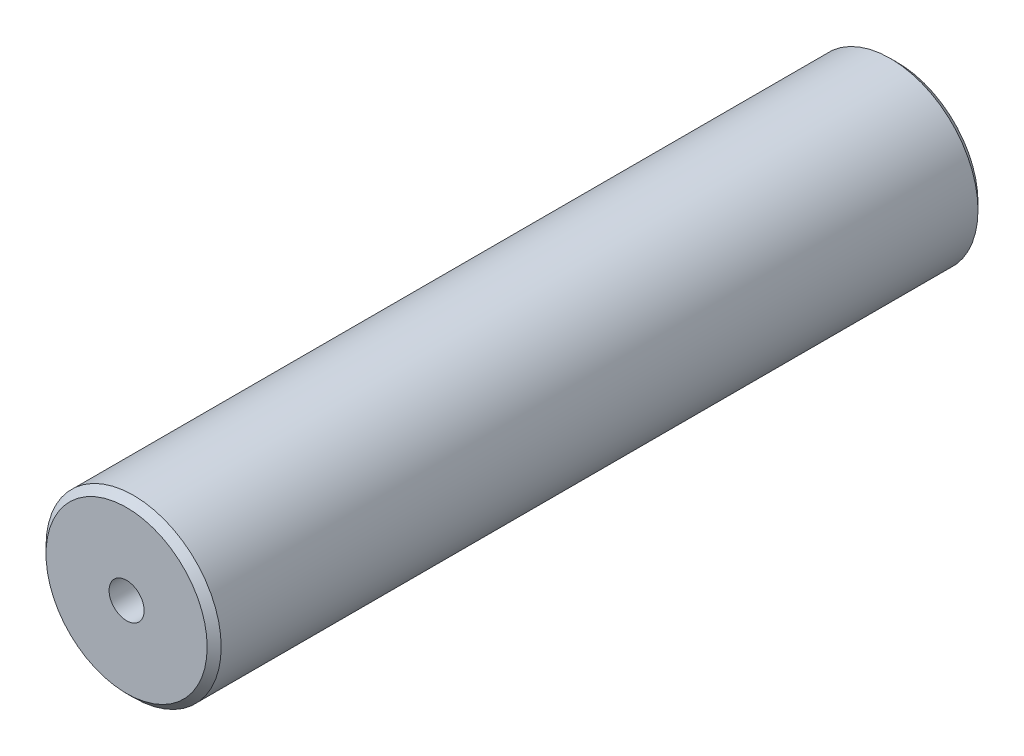
ISO-10303-21;
HEADER;
FILE_DESCRIPTION(('STEP AP214'),'2;1');
FILE_NAME('part.step','',(''),(''),'','','');
FILE_SCHEMA(('AUTOMOTIVE_DESIGN { 1 0 10303 214 1 1 1 1 }'));
ENDSEC;
DATA;
#1=APPLICATION_CONTEXT('core data for automotive mechanical design processes');
#2=APPLICATION_PROTOCOL_DEFINITION('international standard','automotive_design',2000,#1);
#3=PRODUCT_CONTEXT('',#1,'mechanical');
#4=PRODUCT('Part','Part','',(#3));
#5=PRODUCT_RELATED_PRODUCT_CATEGORY('part','',(#4));
#6=PRODUCT_DEFINITION_FORMATION('','',#4);
#7=PRODUCT_DEFINITION_CONTEXT('part definition',#1,'design');
#8=PRODUCT_DEFINITION('design','',#6,#7);
#9=PRODUCT_DEFINITION_SHAPE('','',#8);
#10=(LENGTH_UNIT() NAMED_UNIT(*) SI_UNIT(.MILLI.,.METRE.));
#11=(NAMED_UNIT(*) PLANE_ANGLE_UNIT() SI_UNIT($,.RADIAN.));
#12=(NAMED_UNIT(*) SI_UNIT($,.STERADIAN.) SOLID_ANGLE_UNIT());
#13=UNCERTAINTY_MEASURE_WITH_UNIT(LENGTH_MEASURE(1.E-05),#10,'distance_accuracy_value','');
#14=(GEOMETRIC_REPRESENTATION_CONTEXT(3) GLOBAL_UNCERTAINTY_ASSIGNED_CONTEXT((#13)) GLOBAL_UNIT_ASSIGNED_CONTEXT((#10,
#11,#12)) REPRESENTATION_CONTEXT('',''));
#15=CARTESIAN_POINT('',(0.,0.,0.));
#16=DIRECTION('',(0.,0.,1.));
#17=DIRECTION('',(1.,0.,0.));
#18=AXIS2_PLACEMENT_3D('',#15,#16,#17);
#19=CARTESIAN_POINT('',(0.,0.,55.));
#20=DIRECTION('',(0.,0.,-1.));
#21=DIRECTION('',(-1.,0.,0.));
#22=AXIS2_PLACEMENT_3D('',#19,#20,#21);
#23=CYLINDRICAL_SURFACE('',#22,12.5);
#24=CARTESIAN_POINT('',(0.,0.,-54.));
#25=DIRECTION('',(0.,0.,1.));
#26=DIRECTION('',(1.,0.,0.));
#27=AXIS2_PLACEMENT_3D('',#24,#25,#26);
#28=CIRCLE('',#27,12.5);
#29=CARTESIAN_POINT('',(12.5,0.,-54.));
#30=VERTEX_POINT('',#29);
#31=EDGE_CURVE('E96',#30,#30,#28,.T.);
#32=ORIENTED_EDGE('',*,*,#31,.T.);
#33=EDGE_LOOP('',(#32));
#34=FACE_BOUND('',#33,.T.);
#35=CARTESIAN_POINT('',(0.,0.,54.));
#36=DIRECTION('',(0.,0.,1.));
#37=DIRECTION('',(1.,0.,0.));
#38=AXIS2_PLACEMENT_3D('',#35,#36,#37);
#39=CIRCLE('',#38,12.5);
#40=CARTESIAN_POINT('',(12.5,0.,54.));
#41=VERTEX_POINT('',#40);
#42=EDGE_CURVE('E93',#41,#41,#39,.F.);
#43=ORIENTED_EDGE('',*,*,#42,.T.);
#44=EDGE_LOOP('',(#43));
#45=FACE_BOUND('',#44,.T.);
#46=ADVANCED_FACE('F57',(#34,#45),#23,.T.);
#47=CARTESIAN_POINT('',(0.,0.,55.));
#48=DIRECTION('',(0.,0.,1.));
#49=DIRECTION('',(1.,0.,0.));
#50=AXIS2_PLACEMENT_3D('',#47,#48,#49);
#51=PLANE('',#50);
#52=CARTESIAN_POINT('',(0.,0.,55.));
#53=DIRECTION('',(0.,0.,1.));
#54=DIRECTION('',(1.,0.,0.));
#55=AXIS2_PLACEMENT_3D('',#52,#53,#54);
#56=CIRCLE('',#55,2.49999999999999);
#57=CARTESIAN_POINT('',(2.49999999999999,0.,55.));
#58=VERTEX_POINT('',#57);
#59=EDGE_CURVE('E82',#58,#58,#56,.T.);
#60=ORIENTED_EDGE('',*,*,#59,.F.);
#61=EDGE_LOOP('',(#60));
#62=FACE_BOUND('',#61,.T.);
#63=CARTESIAN_POINT('',(0.,0.,55.));
#64=DIRECTION('',(0.,0.,1.));
#65=DIRECTION('',(1.,0.,0.));
#66=AXIS2_PLACEMENT_3D('',#63,#64,#65);
#67=CIRCLE('',#66,11.5);
#68=CARTESIAN_POINT('',(11.5,0.,55.));
#69=VERTEX_POINT('',#68);
#70=EDGE_CURVE('E13',#69,#69,#67,.T.);
#71=ORIENTED_EDGE('',*,*,#70,.T.);
#72=EDGE_LOOP('',(#71));
#73=FACE_BOUND('',#72,.T.);
#74=ADVANCED_FACE('F110',(#62,#73),#51,.T.);
#75=CARTESIAN_POINT('',(0.,0.,-55.));
#76=DIRECTION('',(0.,0.,1.));
#77=DIRECTION('',(1.,0.,0.));
#78=AXIS2_PLACEMENT_3D('',#75,#76,#77);
#79=PLANE('',#78);
#80=CARTESIAN_POINT('',(0.,0.,-55.));
#81=DIRECTION('',(0.,0.,-1.));
#82=DIRECTION('',(-1.,0.,0.));
#83=AXIS2_PLACEMENT_3D('',#80,#81,#82);
#84=CIRCLE('',#83,2.49999999999999);
#85=CARTESIAN_POINT('',(-2.49999999999999,0.,-55.));
#86=VERTEX_POINT('',#85);
#87=EDGE_CURVE('E83',#86,#86,#84,.T.);
#88=ORIENTED_EDGE('',*,*,#87,.F.);
#89=EDGE_LOOP('',(#88));
#90=FACE_BOUND('',#89,.T.);
#91=CARTESIAN_POINT('',(0.,0.,-55.));
#92=DIRECTION('',(0.,0.,1.));
#93=DIRECTION('',(1.,0.,0.));
#94=AXIS2_PLACEMENT_3D('',#91,#92,#93);
#95=CIRCLE('',#94,11.5);
#96=CARTESIAN_POINT('',(11.5,0.,-55.));
#97=VERTEX_POINT('',#96);
#98=EDGE_CURVE('E66',#97,#97,#95,.F.);
#99=ORIENTED_EDGE('',*,*,#98,.T.);
#100=EDGE_LOOP('',(#99));
#101=FACE_BOUND('',#100,.T.);
#102=ADVANCED_FACE('F101',(#90,#101),#79,.F.);
#103=CARTESIAN_POINT('',(0.,0.,-54.));
#104=DIRECTION('',(0.,0.,1.));
#105=DIRECTION('',(1.,0.,0.));
#106=AXIS2_PLACEMENT_3D('',#103,#104,#105);
#107=CONICAL_SURFACE('',#106,12.5,0.785398163397458);
#108=ORIENTED_EDGE('',*,*,#98,.F.);
#109=EDGE_LOOP('',(#108));
#110=FACE_BOUND('',#109,.T.);
#111=ORIENTED_EDGE('',*,*,#31,.F.);
#112=EDGE_LOOP('',(#111));
#113=FACE_BOUND('',#112,.T.);
#114=ADVANCED_FACE('F103',(#110,#113),#107,.T.);
#115=CARTESIAN_POINT('',(0.,0.,55.));
#116=DIRECTION('',(0.,0.,-1.));
#117=DIRECTION('',(-1.,0.,0.));
#118=AXIS2_PLACEMENT_3D('',#115,#116,#117);
#119=CONICAL_SURFACE('',#118,11.5,0.785398163397443);
#120=ORIENTED_EDGE('',*,*,#42,.F.);
#121=EDGE_LOOP('',(#120));
#122=FACE_BOUND('',#121,.T.);
#123=ORIENTED_EDGE('',*,*,#70,.F.);
#124=EDGE_LOOP('',(#123));
#125=FACE_BOUND('',#124,.T.);
#126=ADVANCED_FACE('F60',(#122,#125),#119,.T.);
#127=CARTESIAN_POINT('',(0.,0.,40.));
#128=DIRECTION('',(0.,0.,1.));
#129=DIRECTION('',(1.,0.,0.));
#130=AXIS2_PLACEMENT_3D('',#127,#128,#129);
#131=CONICAL_SURFACE('',#130,2.5,1.02974425867665);
#132=CARTESIAN_POINT('',(0.,0.,38.4978484524311));
#133=VERTEX_POINT('',#132);
#134=VERTEX_LOOP('',#133);
#135=FACE_BOUND('',#134,.T.);
#136=CARTESIAN_POINT('',(0.,0.,40.));
#137=DIRECTION('',(0.,0.,1.));
#138=DIRECTION('',(1.,0.,0.));
#139=AXIS2_PLACEMENT_3D('',#136,#137,#138);
#140=CIRCLE('',#139,2.5);
#141=CARTESIAN_POINT('',(2.5,0.,40.));
#142=VERTEX_POINT('',#141);
#143=EDGE_CURVE('E86',#142,#142,#140,.T.);
#144=ORIENTED_EDGE('',*,*,#143,.T.);
#145=EDGE_LOOP('',(#144));
#146=FACE_BOUND('',#145,.T.);
#147=ADVANCED_FACE('F116',(#135,#146),#131,.F.);
#148=CARTESIAN_POINT('',(0.,0.,55.));
#149=DIRECTION('',(0.,0.,1.));
#150=DIRECTION('',(1.,0.,0.));
#151=AXIS2_PLACEMENT_3D('',#148,#149,#150);
#152=CYLINDRICAL_SURFACE('',#151,2.49999999999999);
#153=ORIENTED_EDGE('',*,*,#143,.F.);
#154=EDGE_LOOP('',(#153));
#155=FACE_BOUND('',#154,.T.);
#156=ORIENTED_EDGE('',*,*,#59,.T.);
#157=EDGE_LOOP('',(#156));
#158=FACE_BOUND('',#157,.T.);
#159=ADVANCED_FACE('F76',(#155,#158),#152,.F.);
#160=CARTESIAN_POINT('',(0.,0.,-40.));
#161=DIRECTION('',(0.,0.,-1.));
#162=DIRECTION('',(-1.,0.,0.));
#163=AXIS2_PLACEMENT_3D('',#160,#161,#162);
#164=CONICAL_SURFACE('',#163,2.5,1.02974425867665);
#165=CARTESIAN_POINT('',(0.,0.,-38.4978484524311));
#166=VERTEX_POINT('',#165);
#167=VERTEX_LOOP('',#166);
#168=FACE_BOUND('',#167,.T.);
#169=CARTESIAN_POINT('',(0.,0.,-40.));
#170=DIRECTION('',(0.,0.,-1.));
#171=DIRECTION('',(-1.,0.,0.));
#172=AXIS2_PLACEMENT_3D('',#169,#170,#171);
#173=CIRCLE('',#172,2.5);
#174=CARTESIAN_POINT('',(-2.5,0.,-40.));
#175=VERTEX_POINT('',#174);
#176=EDGE_CURVE('E80',#175,#175,#173,.T.);
#177=ORIENTED_EDGE('',*,*,#176,.T.);
#178=EDGE_LOOP('',(#177));
#179=FACE_BOUND('',#178,.T.);
#180=ADVANCED_FACE('F72',(#168,#179),#164,.F.);
#181=CARTESIAN_POINT('',(0.,0.,-55.));
#182=DIRECTION('',(0.,0.,-1.));
#183=DIRECTION('',(-1.,0.,0.));
#184=AXIS2_PLACEMENT_3D('',#181,#182,#183);
#185=CYLINDRICAL_SURFACE('',#184,2.49999999999999);
#186=ORIENTED_EDGE('',*,*,#176,.F.);
#187=EDGE_LOOP('',(#186));
#188=FACE_BOUND('',#187,.T.);
#189=ORIENTED_EDGE('',*,*,#87,.T.);
#190=EDGE_LOOP('',(#189));
#191=FACE_BOUND('',#190,.T.);
#192=ADVANCED_FACE('F75',(#188,#191),#185,.F.);
#193=CLOSED_SHELL('',(#46,#74,#102,#114,#126,#147,#159,#180,#192));
#194=MANIFOLD_SOLID_BREP('B2',#193);
#195=ADVANCED_BREP_SHAPE_REPRESENTATION('',(#18,#194),#14);
#196=SHAPE_DEFINITION_REPRESENTATION(#9,#195);
ENDSEC;
END-ISO-10303-21;
